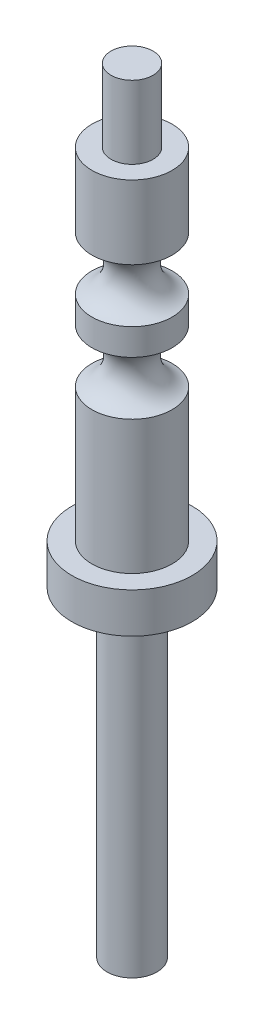
ISO-10303-21;
HEADER;
FILE_DESCRIPTION(('STEP AP214'),'2;1');
FILE_NAME('part.step','',(''),(''),'','','');
FILE_SCHEMA(('AUTOMOTIVE_DESIGN { 1 0 10303 214 1 1 1 1 }'));
ENDSEC;
DATA;
#1=APPLICATION_CONTEXT('core data for automotive mechanical design processes');
#2=APPLICATION_PROTOCOL_DEFINITION('international standard','automotive_design',2000,#1);
#3=PRODUCT_CONTEXT('',#1,'mechanical');
#4=PRODUCT('Part','Part','',(#3));
#5=PRODUCT_RELATED_PRODUCT_CATEGORY('part','',(#4));
#6=PRODUCT_DEFINITION_FORMATION('','',#4);
#7=PRODUCT_DEFINITION_CONTEXT('part definition',#1,'design');
#8=PRODUCT_DEFINITION('design','',#6,#7);
#9=PRODUCT_DEFINITION_SHAPE('','',#8);
#10=(LENGTH_UNIT() NAMED_UNIT(*) SI_UNIT(.MILLI.,.METRE.));
#11=(NAMED_UNIT(*) PLANE_ANGLE_UNIT() SI_UNIT($,.RADIAN.));
#12=(NAMED_UNIT(*) SI_UNIT($,.STERADIAN.) SOLID_ANGLE_UNIT());
#13=UNCERTAINTY_MEASURE_WITH_UNIT(LENGTH_MEASURE(1.E-05),#10,'distance_accuracy_value','');
#14=(GEOMETRIC_REPRESENTATION_CONTEXT(3) GLOBAL_UNCERTAINTY_ASSIGNED_CONTEXT((#13)) GLOBAL_UNIT_ASSIGNED_CONTEXT((#10,
#11,#12)) REPRESENTATION_CONTEXT('',''));
#15=CARTESIAN_POINT('',(0.,0.,0.));
#16=DIRECTION('',(0.,0.,1.));
#17=DIRECTION('',(1.,0.,0.));
#18=AXIS2_PLACEMENT_3D('',#15,#16,#17);
#19=CARTESIAN_POINT('',(0.,0.,0.));
#20=DIRECTION('',(0.,-1.,0.));
#21=DIRECTION('',(0.,0.,-1.));
#22=AXIS2_PLACEMENT_3D('',#19,#20,#21);
#23=CYLINDRICAL_SURFACE('',#22,3.175);
#24=CARTESIAN_POINT('',(0.,45.5041,0.));
#25=DIRECTION('',(0.,-1.,0.));
#26=DIRECTION('',(0.,0.,-1.));
#27=AXIS2_PLACEMENT_3D('',#24,#25,#26);
#28=CIRCLE('',#27,3.175);
#29=CARTESIAN_POINT('',(0.,45.5041,-3.175));
#30=VERTEX_POINT('',#29);
#31=EDGE_CURVE('E67',#30,#30,#28,.T.);
#32=ORIENTED_EDGE('',*,*,#31,.T.);
#33=EDGE_LOOP('',(#32));
#34=FACE_BOUND('',#33,.T.);
#35=CARTESIAN_POINT('',(0.,43.3959,0.));
#36=DIRECTION('',(0.,-1.,0.));
#37=DIRECTION('',(0.,0.,-1.));
#38=AXIS2_PLACEMENT_3D('',#35,#36,#37);
#39=CIRCLE('',#38,3.175);
#40=CARTESIAN_POINT('',(0.,43.3959,-3.175));
#41=VERTEX_POINT('',#40);
#42=EDGE_CURVE('E64',#41,#41,#39,.T.);
#43=ORIENTED_EDGE('',*,*,#42,.F.);
#44=EDGE_LOOP('',(#43));
#45=FACE_BOUND('',#44,.T.);
#46=ADVANCED_FACE('F32',(#34,#45),#23,.T.);
#47=CARTESIAN_POINT('',(0.,39.1541,0.));
#48=DIRECTION('',(0.,-1.,0.));
#49=DIRECTION('',(0.,0.,-1.));
#50=AXIS2_PLACEMENT_3D('',#47,#48,#49);
#51=CIRCLE('',#50,3.175);
#52=CARTESIAN_POINT('',(0.,39.1541,-3.175));
#53=VERTEX_POINT('',#52);
#54=EDGE_CURVE('E59',#53,#53,#51,.T.);
#55=ORIENTED_EDGE('',*,*,#54,.T.);
#56=EDGE_LOOP('',(#55));
#57=FACE_BOUND('',#56,.T.);
#58=CARTESIAN_POINT('',(0.,28.575,0.));
#59=DIRECTION('',(0.,-1.,0.));
#60=DIRECTION('',(0.,0.,-1.));
#61=AXIS2_PLACEMENT_3D('',#58,#59,#60);
#62=CIRCLE('',#61,3.175);
#63=CARTESIAN_POINT('',(0.,28.575,-3.175));
#64=VERTEX_POINT('',#63);
#65=EDGE_CURVE('E36',#64,#64,#62,.F.);
#66=ORIENTED_EDGE('',*,*,#65,.T.);
#67=EDGE_LOOP('',(#66));
#68=FACE_BOUND('',#67,.T.);
#69=ADVANCED_FACE('F81',(#57,#68),#23,.T.);
#70=CARTESIAN_POINT('',(0.,28.575,0.));
#71=DIRECTION('',(0.,-1.,0.));
#72=DIRECTION('',(0.,0.,-1.));
#73=AXIS2_PLACEMENT_3D('',#70,#71,#72);
#74=CYLINDRICAL_SURFACE('',#73,4.7625);
#75=CARTESIAN_POINT('',(0.,28.575,0.));
#76=DIRECTION('',(0.,-1.,0.));
#77=DIRECTION('',(0.,0.,-1.));
#78=AXIS2_PLACEMENT_3D('',#75,#76,#77);
#79=CIRCLE('',#78,4.7625);
#80=CARTESIAN_POINT('',(0.,28.575,-4.7625));
#81=VERTEX_POINT('',#80);
#82=EDGE_CURVE('E58',#81,#81,#79,.T.);
#83=ORIENTED_EDGE('',*,*,#82,.T.);
#84=EDGE_LOOP('',(#83));
#85=FACE_BOUND('',#84,.T.);
#86=CARTESIAN_POINT('',(0.,25.4,0.));
#87=DIRECTION('',(0.,-1.,0.));
#88=DIRECTION('',(0.,0.,-1.));
#89=AXIS2_PLACEMENT_3D('',#86,#87,#88);
#90=CIRCLE('',#89,4.7625);
#91=CARTESIAN_POINT('',(0.,25.4,-4.7625));
#92=VERTEX_POINT('',#91);
#93=EDGE_CURVE('E55',#92,#92,#90,.T.);
#94=ORIENTED_EDGE('',*,*,#93,.F.);
#95=EDGE_LOOP('',(#94));
#96=FACE_BOUND('',#95,.T.);
#97=ADVANCED_FACE('F102',(#85,#96),#74,.T.);
#98=CARTESIAN_POINT('',(0.,28.575,0.));
#99=DIRECTION('',(0.,-1.,0.));
#100=DIRECTION('',(0.,0.,-1.));
#101=AXIS2_PLACEMENT_3D('',#98,#99,#100);
#102=PLANE('',#101);
#103=ORIENTED_EDGE('',*,*,#65,.F.);
#104=EDGE_LOOP('',(#103));
#105=FACE_BOUND('',#104,.T.);
#106=ORIENTED_EDGE('',*,*,#82,.F.);
#107=EDGE_LOOP('',(#106));
#108=FACE_BOUND('',#107,.T.);
#109=ADVANCED_FACE('F116',(#105,#108),#102,.F.);
#110=CARTESIAN_POINT('',(0.,0.,0.));
#111=DIRECTION('',(0.,-1.,0.));
#112=DIRECTION('',(0.,0.,-1.));
#113=AXIS2_PLACEMENT_3D('',#110,#111,#112);
#114=PLANE('',#113);
#115=CARTESIAN_POINT('',(0.,0.,0.));
#116=DIRECTION('',(0.,-1.,0.));
#117=DIRECTION('',(0.,0.,-1.));
#118=AXIS2_PLACEMENT_3D('',#115,#116,#117);
#119=CIRCLE('',#118,1.9812);
#120=CARTESIAN_POINT('',(0.,0.,-1.9812));
#121=VERTEX_POINT('',#120);
#122=EDGE_CURVE('E10',#121,#121,#119,.T.);
#123=ORIENTED_EDGE('',*,*,#122,.T.);
#124=EDGE_LOOP('',(#123));
#125=FACE_BOUND('',#124,.T.);
#126=ADVANCED_FACE('F34',(#125),#114,.T.);
#127=CARTESIAN_POINT('',(0.,0.,0.));
#128=DIRECTION('',(0.,-1.,0.));
#129=DIRECTION('',(0.,0.,-1.));
#130=AXIS2_PLACEMENT_3D('',#127,#128,#129);
#131=CYLINDRICAL_SURFACE('',#130,1.9812);
#132=CARTESIAN_POINT('',(0.,25.4,0.));
#133=DIRECTION('',(0.,-1.,0.));
#134=DIRECTION('',(0.,0.,-1.));
#135=AXIS2_PLACEMENT_3D('',#132,#133,#134);
#136=CIRCLE('',#135,1.9812);
#137=CARTESIAN_POINT('',(0.,25.4,-1.9812));
#138=VERTEX_POINT('',#137);
#139=EDGE_CURVE('E40',#138,#138,#136,.T.);
#140=ORIENTED_EDGE('',*,*,#139,.T.);
#141=EDGE_LOOP('',(#140));
#142=FACE_BOUND('',#141,.T.);
#143=ORIENTED_EDGE('',*,*,#122,.F.);
#144=EDGE_LOOP('',(#143));
#145=FACE_BOUND('',#144,.T.);
#146=ADVANCED_FACE('F109',(#142,#145),#131,.T.);
#147=CARTESIAN_POINT('',(1.9812,25.4,0.));
#148=DIRECTION('',(0.,-1.,0.));
#149=DIRECTION('',(0.,0.,-1.));
#150=AXIS2_PLACEMENT_3D('',#147,#148,#149);
#151=PLANE('',#150);
#152=ORIENTED_EDGE('',*,*,#139,.F.);
#153=EDGE_LOOP('',(#152));
#154=FACE_BOUND('',#153,.T.);
#155=ORIENTED_EDGE('',*,*,#93,.T.);
#156=EDGE_LOOP('',(#155));
#157=FACE_BOUND('',#156,.T.);
#158=ADVANCED_FACE('F106',(#154,#157),#151,.T.);
#159=CARTESIAN_POINT('',(0.,41.275,0.));
#160=DIRECTION('',(0.,-1.,0.));
#161=DIRECTION('',(0.,0.,-1.));
#162=AXIS2_PLACEMENT_3D('',#159,#160,#161);
#163=TOROIDAL_SURFACE('',#162,3.7980112,2.2105112);
#164=ORIENTED_EDGE('',*,*,#54,.F.);
#165=EDGE_LOOP('',(#164));
#166=FACE_BOUND('',#165,.T.);
#167=ORIENTED_EDGE('',*,*,#42,.T.);
#168=EDGE_LOOP('',(#167));
#169=FACE_BOUND('',#168,.T.);
#170=ADVANCED_FACE('F108',(#166,#169),#163,.F.);
#171=CARTESIAN_POINT('',(0.,47.625,0.));
#172=DIRECTION('',(0.,-1.,0.));
#173=DIRECTION('',(0.,0.,-1.));
#174=AXIS2_PLACEMENT_3D('',#171,#172,#173);
#175=TOROIDAL_SURFACE('',#174,3.7980112,2.2105112);
#176=ORIENTED_EDGE('',*,*,#31,.F.);
#177=EDGE_LOOP('',(#176));
#178=FACE_BOUND('',#177,.T.);
#179=CARTESIAN_POINT('',(0.,49.7459,0.));
#180=DIRECTION('',(0.,-1.,0.));
#181=DIRECTION('',(0.,0.,-1.));
#182=AXIS2_PLACEMENT_3D('',#179,#180,#181);
#183=CIRCLE('',#182,3.175);
#184=CARTESIAN_POINT('',(0.,49.7459,-3.175));
#185=VERTEX_POINT('',#184);
#186=EDGE_CURVE('E70',#185,#185,#183,.T.);
#187=ORIENTED_EDGE('',*,*,#186,.T.);
#188=EDGE_LOOP('',(#187));
#189=FACE_BOUND('',#188,.T.);
#190=ADVANCED_FACE('F74',(#178,#189),#175,.F.);
#191=CARTESIAN_POINT('',(1.6637,61.3283,0.));
#192=DIRECTION('',(0.,1.,0.));
#193=DIRECTION('',(0.,0.,1.));
#194=AXIS2_PLACEMENT_3D('',#191,#192,#193);
#195=PLANE('',#194);
#196=CARTESIAN_POINT('',(0.,61.3283,0.));
#197=DIRECTION('',(0.,-1.,0.));
#198=DIRECTION('',(0.,0.,-1.));
#199=AXIS2_PLACEMENT_3D('',#196,#197,#198);
#200=CIRCLE('',#199,1.6637);
#201=CARTESIAN_POINT('',(0.,61.3283,-1.6637));
#202=VERTEX_POINT('',#201);
#203=EDGE_CURVE('E52',#202,#202,#200,.T.);
#204=ORIENTED_EDGE('',*,*,#203,.F.);
#205=EDGE_LOOP('',(#204));
#206=FACE_BOUND('',#205,.T.);
#207=ADVANCED_FACE('F92',(#206),#195,.T.);
#208=CARTESIAN_POINT('',(0.,0.,0.));
#209=DIRECTION('',(0.,-1.,0.));
#210=DIRECTION('',(0.,0.,-1.));
#211=AXIS2_PLACEMENT_3D('',#208,#209,#210);
#212=CYLINDRICAL_SURFACE('',#211,1.6637);
#213=ORIENTED_EDGE('',*,*,#203,.T.);
#214=EDGE_LOOP('',(#213));
#215=FACE_BOUND('',#214,.T.);
#216=CARTESIAN_POINT('',(0.,55.5625,0.));
#217=DIRECTION('',(0.,-1.,0.));
#218=DIRECTION('',(0.,0.,-1.));
#219=AXIS2_PLACEMENT_3D('',#216,#217,#218);
#220=CIRCLE('',#219,1.6637);
#221=CARTESIAN_POINT('',(0.,55.5625,-1.6637));
#222=VERTEX_POINT('',#221);
#223=EDGE_CURVE('E49',#222,#222,#220,.T.);
#224=ORIENTED_EDGE('',*,*,#223,.F.);
#225=EDGE_LOOP('',(#224));
#226=FACE_BOUND('',#225,.T.);
#227=ADVANCED_FACE('F85',(#215,#226),#212,.T.);
#228=CARTESIAN_POINT('',(3.175,55.5625,0.));
#229=DIRECTION('',(0.,1.,0.));
#230=DIRECTION('',(0.,0.,1.));
#231=AXIS2_PLACEMENT_3D('',#228,#229,#230);
#232=PLANE('',#231);
#233=ORIENTED_EDGE('',*,*,#223,.T.);
#234=EDGE_LOOP('',(#233));
#235=FACE_BOUND('',#234,.T.);
#236=CARTESIAN_POINT('',(0.,55.5625,0.));
#237=DIRECTION('',(0.,-1.,0.));
#238=DIRECTION('',(0.,0.,-1.));
#239=AXIS2_PLACEMENT_3D('',#236,#237,#238);
#240=CIRCLE('',#239,3.175);
#241=CARTESIAN_POINT('',(0.,55.5625,-3.175));
#242=VERTEX_POINT('',#241);
#243=EDGE_CURVE('E44',#242,#242,#240,.T.);
#244=ORIENTED_EDGE('',*,*,#243,.F.);
#245=EDGE_LOOP('',(#244));
#246=FACE_BOUND('',#245,.T.);
#247=ADVANCED_FACE('F79',(#235,#246),#232,.T.);
#248=ORIENTED_EDGE('',*,*,#186,.F.);
#249=EDGE_LOOP('',(#248));
#250=FACE_BOUND('',#249,.T.);
#251=ORIENTED_EDGE('',*,*,#243,.T.);
#252=EDGE_LOOP('',(#251));
#253=FACE_BOUND('',#252,.T.);
#254=ADVANCED_FACE('F76',(#250,#253),#23,.T.);
#255=CLOSED_SHELL('',(#46,#69,#97,#109,#126,#146,#158,#170,#190,#207,#227,#247,#254));
#256=MANIFOLD_SOLID_BREP('B2',#255);
#257=ADVANCED_BREP_SHAPE_REPRESENTATION('',(#18,#256),#14);
#258=SHAPE_DEFINITION_REPRESENTATION(#9,#257);
ENDSEC;
END-ISO-10303-21;
